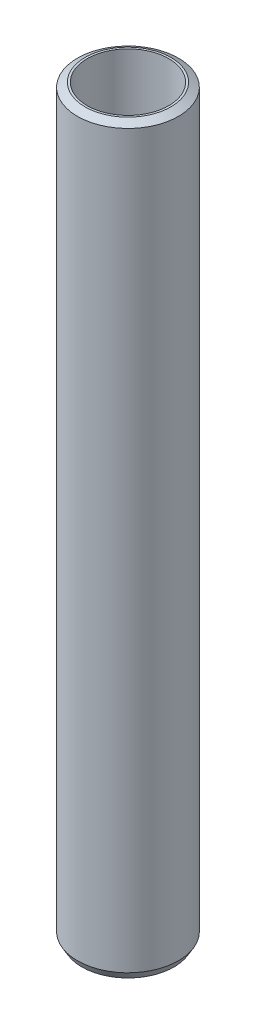
ISO-10303-21;
HEADER;
FILE_DESCRIPTION(('STEP AP214'),'2;1');
FILE_NAME('part.step','',(''),(''),'','','');
FILE_SCHEMA(('AUTOMOTIVE_DESIGN { 1 0 10303 214 1 1 1 1 }'));
ENDSEC;
DATA;
#1=APPLICATION_CONTEXT('core data for automotive mechanical design processes');
#2=APPLICATION_PROTOCOL_DEFINITION('international standard','automotive_design',2000,#1);
#3=PRODUCT_CONTEXT('',#1,'mechanical');
#4=PRODUCT('Part','Part','',(#3));
#5=PRODUCT_RELATED_PRODUCT_CATEGORY('part','',(#4));
#6=PRODUCT_DEFINITION_FORMATION('','',#4);
#7=PRODUCT_DEFINITION_CONTEXT('part definition',#1,'design');
#8=PRODUCT_DEFINITION('design','',#6,#7);
#9=PRODUCT_DEFINITION_SHAPE('','',#8);
#10=(LENGTH_UNIT() NAMED_UNIT(*) SI_UNIT(.MILLI.,.METRE.));
#11=(NAMED_UNIT(*) PLANE_ANGLE_UNIT() SI_UNIT($,.RADIAN.));
#12=(NAMED_UNIT(*) SI_UNIT($,.STERADIAN.) SOLID_ANGLE_UNIT());
#13=UNCERTAINTY_MEASURE_WITH_UNIT(LENGTH_MEASURE(1.E-05),#10,'distance_accuracy_value','');
#14=(GEOMETRIC_REPRESENTATION_CONTEXT(3) GLOBAL_UNCERTAINTY_ASSIGNED_CONTEXT((#13)) GLOBAL_UNIT_ASSIGNED_CONTEXT((#10,
#11,#12)) REPRESENTATION_CONTEXT('',''));
#15=CARTESIAN_POINT('',(0.,0.,0.));
#16=DIRECTION('',(0.,0.,1.));
#17=DIRECTION('',(1.,0.,0.));
#18=AXIS2_PLACEMENT_3D('',#15,#16,#17);
#19=CARTESIAN_POINT('',(0.,331.143968957154,0.));
#20=DIRECTION('',(0.,-1.,0.));
#21=DIRECTION('',(0.,0.,-1.));
#22=AXIS2_PLACEMENT_3D('',#19,#20,#21);
#23=CYLINDRICAL_SURFACE('',#22,22.5);
#24=CARTESIAN_POINT('',(0.,329.184805619958,0.));
#25=DIRECTION('',(0.,1.,0.));
#26=DIRECTION('',(0.,0.,1.));
#27=AXIS2_PLACEMENT_3D('',#24,#25,#26);
#28=CIRCLE('',#27,22.5);
#29=CARTESIAN_POINT('',(0.,329.184805619958,22.5));
#30=VERTEX_POINT('',#29);
#31=EDGE_CURVE('E50',#30,#30,#28,.F.);
#32=ORIENTED_EDGE('',*,*,#31,.T.);
#33=EDGE_LOOP('',(#32));
#34=FACE_BOUND('',#33,.T.);
#35=CARTESIAN_POINT('',(0.,3.3933704403491,0.));
#36=DIRECTION('',(0.,1.,0.));
#37=DIRECTION('',(0.,0.,1.));
#38=AXIS2_PLACEMENT_3D('',#35,#36,#37);
#39=CIRCLE('',#38,22.5);
#40=CARTESIAN_POINT('',(0.,3.3933704403491,22.5));
#41=VERTEX_POINT('',#40);
#42=EDGE_CURVE('E51',#41,#41,#39,.T.);
#43=ORIENTED_EDGE('',*,*,#42,.T.);
#44=EDGE_LOOP('',(#43));
#45=FACE_BOUND('',#44,.T.);
#46=ADVANCED_FACE('F39',(#34,#45),#23,.T.);
#47=CARTESIAN_POINT('',(0.,331.143968957154,0.));
#48=DIRECTION('',(0.,1.,0.));
#49=DIRECTION('',(0.,0.,1.));
#50=AXIS2_PLACEMENT_3D('',#47,#48,#49);
#51=PLANE('',#50);
#52=CARTESIAN_POINT('',(0.,331.143968957154,0.));
#53=DIRECTION('',(0.,1.,0.));
#54=DIRECTION('',(0.,0.,1.));
#55=AXIS2_PLACEMENT_3D('',#52,#53,#54);
#56=CIRCLE('',#55,19.1066295596506);
#57=CARTESIAN_POINT('',(0.,331.143968957154,19.1066295596506));
#58=VERTEX_POINT('',#57);
#59=EDGE_CURVE('E54',#58,#58,#56,.T.);
#60=ORIENTED_EDGE('',*,*,#59,.T.);
#61=EDGE_LOOP('',(#60));
#62=FACE_BOUND('',#61,.T.);
#63=CARTESIAN_POINT('',(0.,331.143968957154,0.));
#64=DIRECTION('',(0.,1.,0.));
#65=DIRECTION('',(0.,0.,1.));
#66=AXIS2_PLACEMENT_3D('',#63,#64,#65);
#67=CIRCLE('',#66,18.1781153578748);
#68=CARTESIAN_POINT('',(0.,331.143968957154,18.1781153578748));
#69=VERTEX_POINT('',#68);
#70=EDGE_CURVE('E58',#69,#69,#67,.T.);
#71=ORIENTED_EDGE('',*,*,#70,.F.);
#72=EDGE_LOOP('',(#71));
#73=FACE_BOUND('',#72,.T.);
#74=ADVANCED_FACE('F69',(#62,#73),#51,.T.);
#75=CARTESIAN_POINT('',(0.,0.,0.));
#76=DIRECTION('',(0.,1.,0.));
#77=DIRECTION('',(0.,0.,1.));
#78=AXIS2_PLACEMENT_3D('',#75,#76,#77);
#79=PLANE('',#78);
#80=CARTESIAN_POINT('',(0.,0.,0.));
#81=DIRECTION('',(0.,1.,0.));
#82=DIRECTION('',(0.,0.,1.));
#83=AXIS2_PLACEMENT_3D('',#80,#81,#82);
#84=CIRCLE('',#83,20.5408366628043);
#85=CARTESIAN_POINT('',(0.,0.,20.5408366628043));
#86=VERTEX_POINT('',#85);
#87=EDGE_CURVE('E10',#86,#86,#84,.F.);
#88=ORIENTED_EDGE('',*,*,#87,.T.);
#89=EDGE_LOOP('',(#88));
#90=FACE_BOUND('',#89,.T.);
#91=CARTESIAN_POINT('',(0.,0.,0.));
#92=DIRECTION('',(0.,1.,0.));
#93=DIRECTION('',(0.,0.,1.));
#94=AXIS2_PLACEMENT_3D('',#91,#92,#93);
#95=CIRCLE('',#94,18.1781153578748);
#96=CARTESIAN_POINT('',(0.,0.,18.1781153578748));
#97=VERTEX_POINT('',#96);
#98=EDGE_CURVE('E63',#97,#97,#95,.T.);
#99=ORIENTED_EDGE('',*,*,#98,.T.);
#100=EDGE_LOOP('',(#99));
#101=FACE_BOUND('',#100,.T.);
#102=ADVANCED_FACE('F75',(#90,#101),#79,.F.);
#103=CARTESIAN_POINT('',(0.,331.143968957154,0.));
#104=DIRECTION('',(0.,-1.,0.));
#105=DIRECTION('',(0.,0.,-1.));
#106=AXIS2_PLACEMENT_3D('',#103,#104,#105);
#107=CYLINDRICAL_SURFACE('',#106,18.1781153578748);
#108=ORIENTED_EDGE('',*,*,#70,.T.);
#109=EDGE_LOOP('',(#108));
#110=FACE_BOUND('',#109,.T.);
#111=ORIENTED_EDGE('',*,*,#98,.F.);
#112=EDGE_LOOP('',(#111));
#113=FACE_BOUND('',#112,.T.);
#114=ADVANCED_FACE('F70',(#110,#113),#107,.F.);
#115=CARTESIAN_POINT('',(0.,331.143968957154,0.));
#116=DIRECTION('',(0.,-1.,0.));
#117=DIRECTION('',(0.,0.,-1.));
#118=AXIS2_PLACEMENT_3D('',#115,#116,#117);
#119=CONICAL_SURFACE('',#118,19.1066295596506,1.0471975511966);
#120=ORIENTED_EDGE('',*,*,#31,.F.);
#121=EDGE_LOOP('',(#120));
#122=FACE_BOUND('',#121,.T.);
#123=ORIENTED_EDGE('',*,*,#59,.F.);
#124=EDGE_LOOP('',(#123));
#125=FACE_BOUND('',#124,.T.);
#126=ADVANCED_FACE('F81',(#122,#125),#119,.T.);
#127=CARTESIAN_POINT('',(0.,3.3933704403491,0.));
#128=DIRECTION('',(0.,1.,0.));
#129=DIRECTION('',(0.,0.,1.));
#130=AXIS2_PLACEMENT_3D('',#127,#128,#129);
#131=CONICAL_SURFACE('',#130,22.5,0.523598775598296);
#132=ORIENTED_EDGE('',*,*,#87,.F.);
#133=EDGE_LOOP('',(#132));
#134=FACE_BOUND('',#133,.T.);
#135=ORIENTED_EDGE('',*,*,#42,.F.);
#136=EDGE_LOOP('',(#135));
#137=FACE_BOUND('',#136,.T.);
#138=ADVANCED_FACE('F45',(#134,#137),#131,.T.);
#139=CLOSED_SHELL('',(#46,#74,#102,#114,#126,#138));
#140=MANIFOLD_SOLID_BREP('B2',#139);
#141=ADVANCED_BREP_SHAPE_REPRESENTATION('',(#18,#140),#14);
#142=SHAPE_DEFINITION_REPRESENTATION(#9,#141);
ENDSEC;
END-ISO-10303-21;
